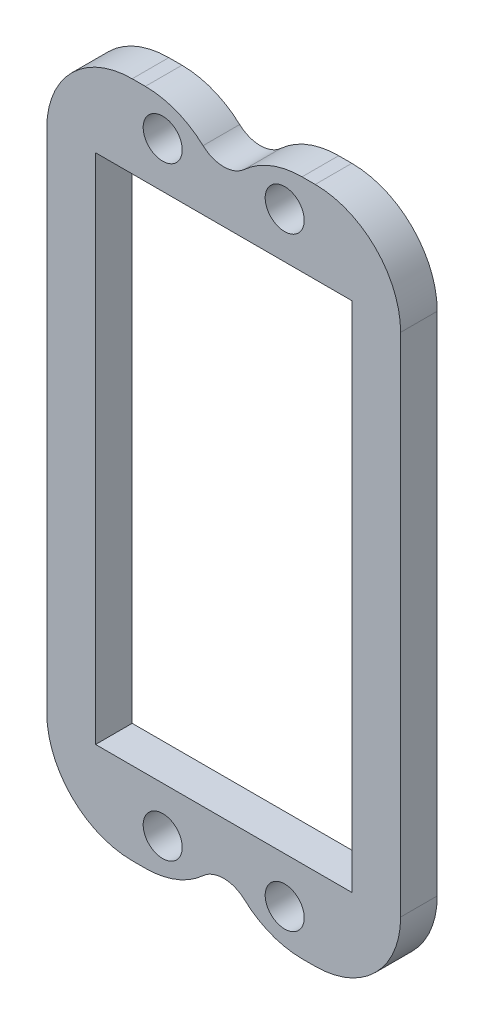
ISO-10303-21;
HEADER;
FILE_DESCRIPTION(('STEP AP214'),'2;1');
FILE_NAME('part.step','',(''),(''),'','','');
FILE_SCHEMA(('AUTOMOTIVE_DESIGN { 1 0 10303 214 1 1 1 1 }'));
ENDSEC;
DATA;
#1=APPLICATION_CONTEXT('core data for automotive mechanical design processes');
#2=APPLICATION_PROTOCOL_DEFINITION('international standard','automotive_design',2000,#1);
#3=PRODUCT_CONTEXT('',#1,'mechanical');
#4=PRODUCT('Part','Part','',(#3));
#5=PRODUCT_RELATED_PRODUCT_CATEGORY('part','',(#4));
#6=PRODUCT_DEFINITION_FORMATION('','',#4);
#7=PRODUCT_DEFINITION_CONTEXT('part definition',#1,'design');
#8=PRODUCT_DEFINITION('design','',#6,#7);
#9=PRODUCT_DEFINITION_SHAPE('','',#8);
#10=(LENGTH_UNIT() NAMED_UNIT(*) SI_UNIT(.MILLI.,.METRE.));
#11=(NAMED_UNIT(*) PLANE_ANGLE_UNIT() SI_UNIT($,.RADIAN.));
#12=(NAMED_UNIT(*) SI_UNIT($,.STERADIAN.) SOLID_ANGLE_UNIT());
#13=UNCERTAINTY_MEASURE_WITH_UNIT(LENGTH_MEASURE(1.E-05),#10,'distance_accuracy_value','');
#14=(GEOMETRIC_REPRESENTATION_CONTEXT(3) GLOBAL_UNCERTAINTY_ASSIGNED_CONTEXT((#13)) GLOBAL_UNIT_ASSIGNED_CONTEXT((#10,
#11,#12)) REPRESENTATION_CONTEXT('',''));
#15=CARTESIAN_POINT('',(0.,0.,0.));
#16=DIRECTION('',(0.,0.,1.));
#17=DIRECTION('',(1.,0.,0.));
#18=AXIS2_PLACEMENT_3D('',#15,#16,#17);
#19=CARTESIAN_POINT('',(0.,-27.75,3.));
#20=DIRECTION('',(0.,1.,0.));
#21=DIRECTION('',(-1.,0.,0.));
#22=AXIS2_PLACEMENT_3D('',#19,#20,#21);
#23=PLANE('',#22);
#24=DIRECTION('',(1.,0.,0.));
#25=VECTOR('',#24,1.);
#26=CARTESIAN_POINT('',(0.,-27.75,0.));
#27=LINE('',#26,#25);
#28=CARTESIAN_POINT('',(-7.5,-27.75,0.));
#29=VERTEX_POINT('',#28);
#30=CARTESIAN_POINT('',(-6.42261628933258,-27.75,0.));
#31=VERTEX_POINT('',#30);
#32=EDGE_CURVE('E249',#29,#31,#27,.T.);
#33=ORIENTED_EDGE('',*,*,#32,.T.);
#34=DIRECTION('',(0.,0.,-1.));
#35=VECTOR('',#34,1.);
#36=CARTESIAN_POINT('',(-6.42261628933258,-27.75,3.));
#37=LINE('',#36,#35);
#38=CARTESIAN_POINT('',(-6.42261628933258,-27.75,3.));
#39=VERTEX_POINT('',#38);
#40=EDGE_CURVE('E318',#31,#39,#37,.F.);
#41=ORIENTED_EDGE('',*,*,#40,.T.);
#42=DIRECTION('',(1.,0.,0.));
#43=VECTOR('',#42,1.);
#44=CARTESIAN_POINT('',(0.,-27.75,3.));
#45=LINE('',#44,#43);
#46=CARTESIAN_POINT('',(-7.5,-27.75,3.));
#47=VERTEX_POINT('',#46);
#48=EDGE_CURVE('E208',#47,#39,#45,.T.);
#49=ORIENTED_EDGE('',*,*,#48,.F.);
#50=DIRECTION('',(0.,0.,-1.));
#51=VECTOR('',#50,1.);
#52=CARTESIAN_POINT('',(-7.5,-27.75,0.));
#53=LINE('',#52,#51);
#54=EDGE_CURVE('E315',#47,#29,#53,.T.);
#55=ORIENTED_EDGE('',*,*,#54,.T.);
#56=EDGE_LOOP('',(#33,#41,#49,#55));
#57=FACE_BOUND('',#56,.T.);
#58=ADVANCED_FACE('F34',(#57),#23,.F.);
#59=CARTESIAN_POINT('',(0.,-27.75,3.));
#60=DIRECTION('',(0.,0.,-1.));
#61=DIRECTION('',(-1.,0.,0.));
#62=AXIS2_PLACEMENT_3D('',#59,#60,#61);
#63=CYLINDRICAL_SURFACE('',#62,2.5);
#64=CARTESIAN_POINT('',(0.,-27.75,0.));
#65=DIRECTION('',(0.,0.,1.));
#66=DIRECTION('',(1.,0.,0.));
#67=AXIS2_PLACEMENT_3D('',#64,#65,#66);
#68=CIRCLE('',#67,2.5);
#69=CARTESIAN_POINT('',(-1.69016218140331,-25.9078947368421,0.));
#70=VERTEX_POINT('',#69);
#71=CARTESIAN_POINT('',(1.69016218140331,-25.9078947368421,0.));
#72=VERTEX_POINT('',#71);
#73=EDGE_CURVE('E252',#70,#72,#68,.F.);
#74=ORIENTED_EDGE('',*,*,#73,.T.);
#75=DIRECTION('',(0.,0.,-1.));
#76=VECTOR('',#75,1.);
#77=CARTESIAN_POINT('',(1.69016218140331,-25.9078947368421,3.));
#78=LINE('',#77,#76);
#79=CARTESIAN_POINT('',(1.69016218140331,-25.9078947368421,3.));
#80=VERTEX_POINT('',#79);
#81=EDGE_CURVE('E298',#72,#80,#78,.F.);
#82=ORIENTED_EDGE('',*,*,#81,.T.);
#83=CARTESIAN_POINT('',(0.,-27.75,3.));
#84=DIRECTION('',(0.,0.,1.));
#85=DIRECTION('',(1.,0.,0.));
#86=AXIS2_PLACEMENT_3D('',#83,#84,#85);
#87=CIRCLE('',#86,2.5);
#88=CARTESIAN_POINT('',(-1.69016218140331,-25.9078947368421,3.));
#89=VERTEX_POINT('',#88);
#90=EDGE_CURVE('E211',#89,#80,#87,.F.);
#91=ORIENTED_EDGE('',*,*,#90,.F.);
#92=DIRECTION('',(0.,0.,-1.));
#93=VECTOR('',#92,1.);
#94=CARTESIAN_POINT('',(-1.69016218140331,-25.9078947368421,3.));
#95=LINE('',#94,#93);
#96=EDGE_CURVE('E295',#89,#70,#95,.T.);
#97=ORIENTED_EDGE('',*,*,#96,.T.);
#98=EDGE_LOOP('',(#74,#82,#91,#97));
#99=FACE_BOUND('',#98,.T.);
#100=ADVANCED_FACE('F363',(#99),#63,.F.);
#101=CARTESIAN_POINT('',(6.42261628933258,-27.75,3.));
#102=VERTEX_POINT('',#101);
#103=CARTESIAN_POINT('',(7.50000000000001,-27.75,3.));
#104=VERTEX_POINT('',#103);
#105=EDGE_CURVE('E212',#102,#104,#45,.T.);
#106=ORIENTED_EDGE('',*,*,#105,.F.);
#107=DIRECTION('',(0.,0.,-1.));
#108=VECTOR('',#107,1.);
#109=CARTESIAN_POINT('',(6.42261628933258,-27.75,3.));
#110=LINE('',#109,#108);
#111=CARTESIAN_POINT('',(6.42261628933258,-27.75,0.));
#112=VERTEX_POINT('',#111);
#113=EDGE_CURVE('E276',#102,#112,#110,.T.);
#114=ORIENTED_EDGE('',*,*,#113,.T.);
#115=CARTESIAN_POINT('',(7.50000000000001,-27.75,0.));
#116=VERTEX_POINT('',#115);
#117=EDGE_CURVE('E253',#112,#116,#27,.T.);
#118=ORIENTED_EDGE('',*,*,#117,.T.);
#119=DIRECTION('',(0.,0.,-1.));
#120=VECTOR('',#119,1.);
#121=CARTESIAN_POINT('',(7.50000000000001,-27.75,3.));
#122=LINE('',#121,#120);
#123=EDGE_CURVE('E181',#116,#104,#122,.F.);
#124=ORIENTED_EDGE('',*,*,#123,.T.);
#125=EDGE_LOOP('',(#106,#114,#118,#124));
#126=FACE_BOUND('',#125,.T.);
#127=ADVANCED_FACE('F372',(#126),#23,.F.);
#128=CARTESIAN_POINT('',(14.5,0.,3.));
#129=DIRECTION('',(-1.,0.,0.));
#130=DIRECTION('',(0.,0.,1.));
#131=AXIS2_PLACEMENT_3D('',#128,#129,#130);
#132=PLANE('',#131);
#133=DIRECTION('',(0.,1.,0.));
#134=VECTOR('',#133,1.);
#135=CARTESIAN_POINT('',(14.5,0.,3.));
#136=LINE('',#135,#134);
#137=CARTESIAN_POINT('',(14.5,-20.75,3.));
#138=VERTEX_POINT('',#137);
#139=CARTESIAN_POINT('',(14.5,20.75,3.));
#140=VERTEX_POINT('',#139);
#141=EDGE_CURVE('E215',#138,#140,#136,.T.);
#142=ORIENTED_EDGE('',*,*,#141,.F.);
#143=DIRECTION('',(0.,0.,-1.));
#144=VECTOR('',#143,1.);
#145=CARTESIAN_POINT('',(14.5,-20.75,3.));
#146=LINE('',#145,#144);
#147=CARTESIAN_POINT('',(14.5,-20.75,0.));
#148=VERTEX_POINT('',#147);
#149=EDGE_CURVE('E337',#138,#148,#146,.T.);
#150=ORIENTED_EDGE('',*,*,#149,.T.);
#151=DIRECTION('',(0.,1.,0.));
#152=VECTOR('',#151,1.);
#153=CARTESIAN_POINT('',(14.5,0.,0.));
#154=LINE('',#153,#152);
#155=CARTESIAN_POINT('',(14.5,20.75,0.));
#156=VERTEX_POINT('',#155);
#157=EDGE_CURVE('E256',#148,#156,#154,.T.);
#158=ORIENTED_EDGE('',*,*,#157,.T.);
#159=DIRECTION('',(0.,0.,-1.));
#160=VECTOR('',#159,1.);
#161=CARTESIAN_POINT('',(14.5,20.75,3.));
#162=LINE('',#161,#160);
#163=EDGE_CURVE('E335',#156,#140,#162,.F.);
#164=ORIENTED_EDGE('',*,*,#163,.T.);
#165=EDGE_LOOP('',(#142,#150,#158,#164));
#166=FACE_BOUND('',#165,.T.);
#167=ADVANCED_FACE('F382',(#166),#132,.F.);
#168=CARTESIAN_POINT('',(0.,27.75,3.));
#169=DIRECTION('',(0.,1.,0.));
#170=DIRECTION('',(-1.,0.,0.));
#171=AXIS2_PLACEMENT_3D('',#168,#169,#170);
#172=PLANE('',#171);
#173=DIRECTION('',(1.,0.,0.));
#174=VECTOR('',#173,1.);
#175=CARTESIAN_POINT('',(0.,27.75,0.));
#176=LINE('',#175,#174);
#177=CARTESIAN_POINT('',(6.42261628933257,27.75,0.));
#178=VERTEX_POINT('',#177);
#179=CARTESIAN_POINT('',(7.50000000000001,27.75,0.));
#180=VERTEX_POINT('',#179);
#181=EDGE_CURVE('E259',#178,#180,#176,.T.);
#182=ORIENTED_EDGE('',*,*,#181,.F.);
#183=DIRECTION('',(0.,0.,-1.));
#184=VECTOR('',#183,1.);
#185=CARTESIAN_POINT('',(6.42261628933257,27.75,3.));
#186=LINE('',#185,#184);
#187=CARTESIAN_POINT('',(6.42261628933257,27.75,3.));
#188=VERTEX_POINT('',#187);
#189=EDGE_CURVE('E328',#178,#188,#186,.F.);
#190=ORIENTED_EDGE('',*,*,#189,.T.);
#191=DIRECTION('',(1.,0.,0.));
#192=VECTOR('',#191,1.);
#193=CARTESIAN_POINT('',(0.,27.75,3.));
#194=LINE('',#193,#192);
#195=CARTESIAN_POINT('',(7.50000000000001,27.75,3.));
#196=VERTEX_POINT('',#195);
#197=EDGE_CURVE('E218',#188,#196,#194,.T.);
#198=ORIENTED_EDGE('',*,*,#197,.T.);
#199=DIRECTION('',(0.,0.,-1.));
#200=VECTOR('',#199,1.);
#201=CARTESIAN_POINT('',(7.50000000000001,27.75,0.));
#202=LINE('',#201,#200);
#203=EDGE_CURVE('E325',#196,#180,#202,.T.);
#204=ORIENTED_EDGE('',*,*,#203,.T.);
#205=EDGE_LOOP('',(#182,#190,#198,#204));
#206=FACE_BOUND('',#205,.T.);
#207=ADVANCED_FACE('F390',(#206),#172,.T.);
#208=CARTESIAN_POINT('',(0.,27.75,3.));
#209=DIRECTION('',(0.,0.,-1.));
#210=DIRECTION('',(-1.,0.,0.));
#211=AXIS2_PLACEMENT_3D('',#208,#209,#210);
#212=CYLINDRICAL_SURFACE('',#211,2.5);
#213=CARTESIAN_POINT('',(0.,27.75,3.));
#214=DIRECTION('',(0.,0.,1.));
#215=DIRECTION('',(1.,0.,0.));
#216=AXIS2_PLACEMENT_3D('',#213,#214,#215);
#217=CIRCLE('',#216,2.5);
#218=CARTESIAN_POINT('',(-1.69016218140331,25.9078947368421,3.));
#219=VERTEX_POINT('',#218);
#220=CARTESIAN_POINT('',(1.69016218140331,25.9078947368421,3.));
#221=VERTEX_POINT('',#220);
#222=EDGE_CURVE('E223',#219,#221,#217,.T.);
#223=ORIENTED_EDGE('',*,*,#222,.T.);
#224=DIRECTION('',(0.,0.,-1.));
#225=VECTOR('',#224,1.);
#226=CARTESIAN_POINT('',(1.69016218140331,25.9078947368421,3.));
#227=LINE('',#226,#225);
#228=CARTESIAN_POINT('',(1.69016218140331,25.9078947368421,0.));
#229=VERTEX_POINT('',#228);
#230=EDGE_CURVE('E322',#221,#229,#227,.T.);
#231=ORIENTED_EDGE('',*,*,#230,.T.);
#232=CARTESIAN_POINT('',(0.,27.75,0.));
#233=DIRECTION('',(0.,0.,1.));
#234=DIRECTION('',(1.,0.,0.));
#235=AXIS2_PLACEMENT_3D('',#232,#233,#234);
#236=CIRCLE('',#235,2.5);
#237=CARTESIAN_POINT('',(-1.69016218140331,25.9078947368421,0.));
#238=VERTEX_POINT('',#237);
#239=EDGE_CURVE('E262',#238,#229,#236,.T.);
#240=ORIENTED_EDGE('',*,*,#239,.F.);
#241=DIRECTION('',(0.,0.,-1.));
#242=VECTOR('',#241,1.);
#243=CARTESIAN_POINT('',(-1.69016218140331,25.9078947368421,3.));
#244=LINE('',#243,#242);
#245=EDGE_CURVE('E320',#238,#219,#244,.F.);
#246=ORIENTED_EDGE('',*,*,#245,.T.);
#247=EDGE_LOOP('',(#223,#231,#240,#246));
#248=FACE_BOUND('',#247,.T.);
#249=ADVANCED_FACE('F400',(#248),#212,.F.);
#250=CARTESIAN_POINT('',(-7.50000000000001,27.75,3.));
#251=VERTEX_POINT('',#250);
#252=CARTESIAN_POINT('',(-6.42261628933257,27.75,3.));
#253=VERTEX_POINT('',#252);
#254=EDGE_CURVE('E219',#251,#253,#194,.T.);
#255=ORIENTED_EDGE('',*,*,#254,.T.);
#256=DIRECTION('',(0.,0.,-1.));
#257=VECTOR('',#256,1.);
#258=CARTESIAN_POINT('',(-6.42261628933257,27.75,3.));
#259=LINE('',#258,#257);
#260=CARTESIAN_POINT('',(-6.42261628933257,27.75,0.));
#261=VERTEX_POINT('',#260);
#262=EDGE_CURVE('E332',#253,#261,#259,.T.);
#263=ORIENTED_EDGE('',*,*,#262,.T.);
#264=CARTESIAN_POINT('',(-7.50000000000001,27.75,0.));
#265=VERTEX_POINT('',#264);
#266=EDGE_CURVE('E263',#265,#261,#176,.T.);
#267=ORIENTED_EDGE('',*,*,#266,.F.);
#268=DIRECTION('',(0.,0.,-1.));
#269=VECTOR('',#268,1.);
#270=CARTESIAN_POINT('',(-7.50000000000001,27.75,3.));
#271=LINE('',#270,#269);
#272=EDGE_CURVE('E330',#265,#251,#271,.F.);
#273=ORIENTED_EDGE('',*,*,#272,.T.);
#274=EDGE_LOOP('',(#255,#263,#267,#273));
#275=FACE_BOUND('',#274,.T.);
#276=ADVANCED_FACE('F407',(#275),#172,.T.);
#277=CARTESIAN_POINT('',(10.5,0.,3.));
#278=DIRECTION('',(-1.,0.,0.));
#279=DIRECTION('',(0.,0.,1.));
#280=AXIS2_PLACEMENT_3D('',#277,#278,#279);
#281=PLANE('',#280);
#282=DIRECTION('',(0.,1.,0.));
#283=VECTOR('',#282,1.);
#284=CARTESIAN_POINT('',(10.5,0.,0.));
#285=LINE('',#284,#283);
#286=CARTESIAN_POINT('',(10.5,-21.,0.));
#287=VERTEX_POINT('',#286);
#288=CARTESIAN_POINT('',(10.5,21.,0.));
#289=VERTEX_POINT('',#288);
#290=EDGE_CURVE('E176',#287,#289,#285,.T.);
#291=ORIENTED_EDGE('',*,*,#290,.F.);
#292=DIRECTION('',(0.,0.,-1.));
#293=VECTOR('',#292,1.);
#294=CARTESIAN_POINT('',(10.5,-21.,3.));
#295=LINE('',#294,#293);
#296=CARTESIAN_POINT('',(10.5,-21.,3.));
#297=VERTEX_POINT('',#296);
#298=EDGE_CURVE('E171',#297,#287,#295,.T.);
#299=ORIENTED_EDGE('',*,*,#298,.F.);
#300=DIRECTION('',(0.,1.,0.));
#301=VECTOR('',#300,1.);
#302=CARTESIAN_POINT('',(10.5,0.,3.));
#303=LINE('',#302,#301);
#304=CARTESIAN_POINT('',(10.5,21.,3.));
#305=VERTEX_POINT('',#304);
#306=EDGE_CURVE('E174',#297,#305,#303,.T.);
#307=ORIENTED_EDGE('',*,*,#306,.T.);
#308=DIRECTION('',(0.,0.,-1.));
#309=VECTOR('',#308,1.);
#310=CARTESIAN_POINT('',(10.5,21.,3.));
#311=LINE('',#310,#309);
#312=EDGE_CURVE('E227',#305,#289,#311,.T.);
#313=ORIENTED_EDGE('',*,*,#312,.T.);
#314=EDGE_LOOP('',(#291,#299,#307,#313));
#315=FACE_BOUND('',#314,.T.);
#316=ADVANCED_FACE('F173',(#315),#281,.T.);
#317=CARTESIAN_POINT('',(0.,-21.,3.));
#318=DIRECTION('',(0.,1.,0.));
#319=DIRECTION('',(0.,0.,1.));
#320=AXIS2_PLACEMENT_3D('',#317,#318,#319);
#321=PLANE('',#320);
#322=DIRECTION('',(1.,0.,0.));
#323=VECTOR('',#322,1.);
#324=CARTESIAN_POINT('',(0.,-21.,0.));
#325=LINE('',#324,#323);
#326=CARTESIAN_POINT('',(-10.5,-21.,0.));
#327=VERTEX_POINT('',#326);
#328=EDGE_CURVE('E235',#327,#287,#325,.T.);
#329=ORIENTED_EDGE('',*,*,#328,.F.);
#330=DIRECTION('',(0.,0.,-1.));
#331=VECTOR('',#330,1.);
#332=CARTESIAN_POINT('',(-10.5,-21.,3.));
#333=LINE('',#332,#331);
#334=CARTESIAN_POINT('',(-10.5,-21.,3.));
#335=VERTEX_POINT('',#334);
#336=EDGE_CURVE('E182',#335,#327,#333,.T.);
#337=ORIENTED_EDGE('',*,*,#336,.F.);
#338=DIRECTION('',(1.,0.,0.));
#339=VECTOR('',#338,1.);
#340=CARTESIAN_POINT('',(0.,-21.,3.));
#341=LINE('',#340,#339);
#342=EDGE_CURVE('E189',#335,#297,#341,.T.);
#343=ORIENTED_EDGE('',*,*,#342,.T.);
#344=ORIENTED_EDGE('',*,*,#298,.T.);
#345=EDGE_LOOP('',(#329,#337,#343,#344));
#346=FACE_BOUND('',#345,.T.);
#347=ADVANCED_FACE('F194',(#346),#321,.T.);
#348=CARTESIAN_POINT('',(-10.5,0.,3.));
#349=DIRECTION('',(-1.,0.,0.));
#350=DIRECTION('',(0.,0.,1.));
#351=AXIS2_PLACEMENT_3D('',#348,#349,#350);
#352=PLANE('',#351);
#353=DIRECTION('',(0.,1.,0.));
#354=VECTOR('',#353,1.);
#355=CARTESIAN_POINT('',(-10.5,0.,0.));
#356=LINE('',#355,#354);
#357=CARTESIAN_POINT('',(-10.5,21.,0.));
#358=VERTEX_POINT('',#357);
#359=EDGE_CURVE('E237',#327,#358,#356,.T.);
#360=ORIENTED_EDGE('',*,*,#359,.T.);
#361=DIRECTION('',(0.,0.,-1.));
#362=VECTOR('',#361,1.);
#363=CARTESIAN_POINT('',(-10.5,21.,3.));
#364=LINE('',#363,#362);
#365=CARTESIAN_POINT('',(-10.5,21.,3.));
#366=VERTEX_POINT('',#365);
#367=EDGE_CURVE('E271',#366,#358,#364,.T.);
#368=ORIENTED_EDGE('',*,*,#367,.F.);
#369=DIRECTION('',(0.,1.,0.));
#370=VECTOR('',#369,1.);
#371=CARTESIAN_POINT('',(-10.5,0.,3.));
#372=LINE('',#371,#370);
#373=EDGE_CURVE('E196',#335,#366,#372,.T.);
#374=ORIENTED_EDGE('',*,*,#373,.F.);
#375=ORIENTED_EDGE('',*,*,#336,.T.);
#376=EDGE_LOOP('',(#360,#368,#374,#375));
#377=FACE_BOUND('',#376,.T.);
#378=ADVANCED_FACE('F468',(#377),#352,.F.);
#379=CARTESIAN_POINT('',(-4.99999999999999,24.75,3.));
#380=DIRECTION('',(0.,0.,-1.));
#381=DIRECTION('',(-1.,0.,0.));
#382=AXIS2_PLACEMENT_3D('',#379,#380,#381);
#383=CYLINDRICAL_SURFACE('',#382,1.6);
#384=CARTESIAN_POINT('',(-4.99999999999999,24.75,3.));
#385=DIRECTION('',(0.,0.,1.));
#386=DIRECTION('',(1.,0.,0.));
#387=AXIS2_PLACEMENT_3D('',#384,#385,#386);
#388=CIRCLE('',#387,1.6);
#389=CARTESIAN_POINT('',(-3.4,24.75,3.));
#390=VERTEX_POINT('',#389);
#391=EDGE_CURVE('E205',#390,#390,#388,.F.);
#392=ORIENTED_EDGE('',*,*,#391,.F.);
#393=EDGE_LOOP('',(#392));
#394=FACE_BOUND('',#393,.T.);
#395=CARTESIAN_POINT('',(-4.99999999999999,24.75,0.));
#396=DIRECTION('',(0.,0.,1.));
#397=DIRECTION('',(1.,0.,0.));
#398=AXIS2_PLACEMENT_3D('',#395,#396,#397);
#399=CIRCLE('',#398,1.6);
#400=CARTESIAN_POINT('',(-3.4,24.75,0.));
#401=VERTEX_POINT('',#400);
#402=EDGE_CURVE('E246',#401,#401,#399,.F.);
#403=ORIENTED_EDGE('',*,*,#402,.T.);
#404=EDGE_LOOP('',(#403));
#405=FACE_BOUND('',#404,.T.);
#406=ADVANCED_FACE('F465',(#394,#405),#383,.F.);
#407=CARTESIAN_POINT('',(5.,24.75,3.));
#408=DIRECTION('',(0.,0.,-1.));
#409=DIRECTION('',(-1.,0.,0.));
#410=AXIS2_PLACEMENT_3D('',#407,#408,#409);
#411=CYLINDRICAL_SURFACE('',#410,1.6);
#412=CARTESIAN_POINT('',(5.,24.75,3.));
#413=DIRECTION('',(0.,0.,1.));
#414=DIRECTION('',(1.,0.,0.));
#415=AXIS2_PLACEMENT_3D('',#412,#413,#414);
#416=CIRCLE('',#415,1.6);
#417=CARTESIAN_POINT('',(6.6,24.75,3.));
#418=VERTEX_POINT('',#417);
#419=EDGE_CURVE('E202',#418,#418,#416,.T.);
#420=ORIENTED_EDGE('',*,*,#419,.T.);
#421=EDGE_LOOP('',(#420));
#422=FACE_BOUND('',#421,.T.);
#423=CARTESIAN_POINT('',(5.,24.75,0.));
#424=DIRECTION('',(0.,0.,1.));
#425=DIRECTION('',(1.,0.,0.));
#426=AXIS2_PLACEMENT_3D('',#423,#424,#425);
#427=CIRCLE('',#426,1.6);
#428=CARTESIAN_POINT('',(6.6,24.75,0.));
#429=VERTEX_POINT('',#428);
#430=EDGE_CURVE('E243',#429,#429,#427,.T.);
#431=ORIENTED_EDGE('',*,*,#430,.F.);
#432=EDGE_LOOP('',(#431));
#433=FACE_BOUND('',#432,.T.);
#434=ADVANCED_FACE('F467',(#422,#433),#411,.F.);
#435=CARTESIAN_POINT('',(0.,21.,3.));
#436=DIRECTION('',(0.,1.,0.));
#437=DIRECTION('',(0.,0.,1.));
#438=AXIS2_PLACEMENT_3D('',#435,#436,#437);
#439=PLANE('',#438);
#440=DIRECTION('',(1.,0.,0.));
#441=VECTOR('',#440,1.);
#442=CARTESIAN_POINT('',(0.,21.,0.));
#443=LINE('',#442,#441);
#444=EDGE_CURVE('E240',#358,#289,#443,.T.);
#445=ORIENTED_EDGE('',*,*,#444,.T.);
#446=ORIENTED_EDGE('',*,*,#312,.F.);
#447=DIRECTION('',(1.,0.,0.));
#448=VECTOR('',#447,1.);
#449=CARTESIAN_POINT('',(0.,21.,3.));
#450=LINE('',#449,#448);
#451=EDGE_CURVE('E190',#366,#305,#450,.T.);
#452=ORIENTED_EDGE('',*,*,#451,.F.);
#453=ORIENTED_EDGE('',*,*,#367,.T.);
#454=EDGE_LOOP('',(#445,#446,#452,#453));
#455=FACE_BOUND('',#454,.T.);
#456=ADVANCED_FACE('F455',(#455),#439,.F.);
#457=CARTESIAN_POINT('',(-4.99999999999999,-24.75,3.));
#458=DIRECTION('',(0.,0.,-1.));
#459=DIRECTION('',(-1.,0.,0.));
#460=AXIS2_PLACEMENT_3D('',#457,#458,#459);
#461=CYLINDRICAL_SURFACE('',#460,1.6);
#462=CARTESIAN_POINT('',(-4.99999999999999,-24.75,3.));
#463=DIRECTION('',(0.,0.,1.));
#464=DIRECTION('',(1.,0.,0.));
#465=AXIS2_PLACEMENT_3D('',#462,#463,#464);
#466=CIRCLE('',#465,1.6);
#467=CARTESIAN_POINT('',(-3.4,-24.75,3.));
#468=VERTEX_POINT('',#467);
#469=EDGE_CURVE('E192',#468,#468,#466,.T.);
#470=ORIENTED_EDGE('',*,*,#469,.T.);
#471=EDGE_LOOP('',(#470));
#472=FACE_BOUND('',#471,.T.);
#473=CARTESIAN_POINT('',(-4.99999999999999,-24.75,0.));
#474=DIRECTION('',(0.,0.,1.));
#475=DIRECTION('',(1.,0.,0.));
#476=AXIS2_PLACEMENT_3D('',#473,#474,#475);
#477=CIRCLE('',#476,1.6);
#478=CARTESIAN_POINT('',(-3.4,-24.75,0.));
#479=VERTEX_POINT('',#478);
#480=EDGE_CURVE('E231',#479,#479,#477,.T.);
#481=ORIENTED_EDGE('',*,*,#480,.F.);
#482=EDGE_LOOP('',(#481));
#483=FACE_BOUND('',#482,.T.);
#484=ADVANCED_FACE('F452',(#472,#483),#461,.F.);
#485=CARTESIAN_POINT('',(5.00000000000001,-24.75,3.));
#486=DIRECTION('',(0.,0.,-1.));
#487=DIRECTION('',(-1.,0.,0.));
#488=AXIS2_PLACEMENT_3D('',#485,#486,#487);
#489=CYLINDRICAL_SURFACE('',#488,1.6);
#490=CARTESIAN_POINT('',(5.00000000000001,-24.75,3.));
#491=DIRECTION('',(0.,0.,1.));
#492=DIRECTION('',(1.,0.,0.));
#493=AXIS2_PLACEMENT_3D('',#490,#491,#492);
#494=CIRCLE('',#493,1.6);
#495=CARTESIAN_POINT('',(6.6,-24.75,3.));
#496=VERTEX_POINT('',#495);
#497=EDGE_CURVE('E269',#496,#496,#494,.F.);
#498=ORIENTED_EDGE('',*,*,#497,.F.);
#499=EDGE_LOOP('',(#498));
#500=FACE_BOUND('',#499,.T.);
#501=CARTESIAN_POINT('',(5.00000000000001,-24.75,0.));
#502=DIRECTION('',(0.,0.,1.));
#503=DIRECTION('',(1.,0.,0.));
#504=AXIS2_PLACEMENT_3D('',#501,#502,#503);
#505=CIRCLE('',#504,1.6);
#506=CARTESIAN_POINT('',(6.6,-24.75,0.));
#507=VERTEX_POINT('',#506);
#508=EDGE_CURVE('E228',#507,#507,#505,.F.);
#509=ORIENTED_EDGE('',*,*,#508,.T.);
#510=EDGE_LOOP('',(#509));
#511=FACE_BOUND('',#510,.T.);
#512=ADVANCED_FACE('F437',(#500,#511),#489,.F.);
#513=CARTESIAN_POINT('',(-14.5,0.,3.));
#514=DIRECTION('',(-1.,0.,0.));
#515=DIRECTION('',(0.,-1.,0.));
#516=AXIS2_PLACEMENT_3D('',#513,#514,#515);
#517=PLANE('',#516);
#518=DIRECTION('',(0.,1.,0.));
#519=VECTOR('',#518,1.);
#520=CARTESIAN_POINT('',(-14.5,0.,0.));
#521=LINE('',#520,#519);
#522=CARTESIAN_POINT('',(-14.5,-20.75,0.));
#523=VERTEX_POINT('',#522);
#524=CARTESIAN_POINT('',(-14.5,20.75,0.));
#525=VERTEX_POINT('',#524);
#526=EDGE_CURVE('E266',#523,#525,#521,.T.);
#527=ORIENTED_EDGE('',*,*,#526,.F.);
#528=DIRECTION('',(0.,0.,-1.));
#529=VECTOR('',#528,1.);
#530=CARTESIAN_POINT('',(-14.5,-20.75,3.));
#531=LINE('',#530,#529);
#532=CARTESIAN_POINT('',(-14.5,-20.75,3.));
#533=VERTEX_POINT('',#532);
#534=EDGE_CURVE('E11',#523,#533,#531,.F.);
#535=ORIENTED_EDGE('',*,*,#534,.T.);
#536=DIRECTION('',(0.,1.,0.));
#537=VECTOR('',#536,1.);
#538=CARTESIAN_POINT('',(-14.5,0.,3.));
#539=LINE('',#538,#537);
#540=CARTESIAN_POINT('',(-14.5,20.75,3.));
#541=VERTEX_POINT('',#540);
#542=EDGE_CURVE('E222',#533,#541,#539,.T.);
#543=ORIENTED_EDGE('',*,*,#542,.T.);
#544=DIRECTION('',(0.,0.,-1.));
#545=VECTOR('',#544,1.);
#546=CARTESIAN_POINT('',(-14.5,20.75,3.));
#547=LINE('',#546,#545);
#548=EDGE_CURVE('E42',#541,#525,#547,.T.);
#549=ORIENTED_EDGE('',*,*,#548,.T.);
#550=EDGE_LOOP('',(#527,#535,#543,#549));
#551=FACE_BOUND('',#550,.T.);
#552=ADVANCED_FACE('F341',(#551),#517,.T.);
#553=CARTESIAN_POINT('',(0.,0.,3.));
#554=DIRECTION('',(0.,0.,1.));
#555=DIRECTION('',(1.,0.,0.));
#556=AXIS2_PLACEMENT_3D('',#553,#554,#555);
#557=PLANE('',#556);
#558=ORIENTED_EDGE('',*,*,#497,.T.);
#559=EDGE_LOOP('',(#558));
#560=FACE_BOUND('',#559,.T.);
#561=ORIENTED_EDGE('',*,*,#469,.F.);
#562=EDGE_LOOP('',(#561));
#563=FACE_BOUND('',#562,.T.);
#564=ORIENTED_EDGE('',*,*,#306,.F.);
#565=ORIENTED_EDGE('',*,*,#342,.F.);
#566=ORIENTED_EDGE('',*,*,#373,.T.);
#567=ORIENTED_EDGE('',*,*,#451,.T.);
#568=EDGE_LOOP('',(#564,#565,#566,#567));
#569=FACE_BOUND('',#568,.T.);
#570=ORIENTED_EDGE('',*,*,#419,.F.);
#571=EDGE_LOOP('',(#570));
#572=FACE_BOUND('',#571,.T.);
#573=ORIENTED_EDGE('',*,*,#391,.T.);
#574=EDGE_LOOP('',(#573));
#575=FACE_BOUND('',#574,.T.);
#576=ORIENTED_EDGE('',*,*,#90,.T.);
#577=CARTESIAN_POINT('',(6.42261628933257,-20.75,3.));
#578=DIRECTION('',(0.,0.,1.));
#579=DIRECTION('',(1.,0.,0.));
#580=AXIS2_PLACEMENT_3D('',#577,#578,#579);
#581=CIRCLE('',#580,7.);
#582=EDGE_CURVE('E313',#80,#102,#581,.T.);
#583=ORIENTED_EDGE('',*,*,#582,.T.);
#584=ORIENTED_EDGE('',*,*,#105,.T.);
#585=CARTESIAN_POINT('',(7.50000000000001,-20.75,3.));
#586=DIRECTION('',(0.,0.,1.));
#587=DIRECTION('',(1.,0.,0.));
#588=AXIS2_PLACEMENT_3D('',#585,#586,#587);
#589=CIRCLE('',#588,7.);
#590=EDGE_CURVE('E305',#104,#138,#589,.T.);
#591=ORIENTED_EDGE('',*,*,#590,.T.);
#592=ORIENTED_EDGE('',*,*,#141,.T.);
#593=CARTESIAN_POINT('',(7.50000000000001,20.75,3.));
#594=DIRECTION('',(0.,0.,1.));
#595=DIRECTION('',(1.,0.,0.));
#596=AXIS2_PLACEMENT_3D('',#593,#594,#595);
#597=CIRCLE('',#596,7.);
#598=EDGE_CURVE('E300',#140,#196,#597,.T.);
#599=ORIENTED_EDGE('',*,*,#598,.T.);
#600=ORIENTED_EDGE('',*,*,#197,.F.);
#601=CARTESIAN_POINT('',(6.42261628933257,20.75,3.));
#602=DIRECTION('',(0.,0.,1.));
#603=DIRECTION('',(1.,0.,0.));
#604=AXIS2_PLACEMENT_3D('',#601,#602,#603);
#605=CIRCLE('',#604,7.);
#606=EDGE_CURVE('E309',#188,#221,#605,.T.);
#607=ORIENTED_EDGE('',*,*,#606,.T.);
#608=ORIENTED_EDGE('',*,*,#222,.F.);
#609=CARTESIAN_POINT('',(-6.42261628933257,20.75,3.));
#610=DIRECTION('',(0.,0.,1.));
#611=DIRECTION('',(1.,0.,0.));
#612=AXIS2_PLACEMENT_3D('',#609,#610,#611);
#613=CIRCLE('',#612,7.);
#614=EDGE_CURVE('E307',#219,#253,#613,.T.);
#615=ORIENTED_EDGE('',*,*,#614,.T.);
#616=ORIENTED_EDGE('',*,*,#254,.F.);
#617=CARTESIAN_POINT('',(-7.50000000000001,20.75,3.));
#618=DIRECTION('',(0.,0.,1.));
#619=DIRECTION('',(1.,0.,0.));
#620=AXIS2_PLACEMENT_3D('',#617,#618,#619);
#621=CIRCLE('',#620,7.);
#622=EDGE_CURVE('E49',#251,#541,#621,.T.);
#623=ORIENTED_EDGE('',*,*,#622,.T.);
#624=ORIENTED_EDGE('',*,*,#542,.F.);
#625=CARTESIAN_POINT('',(-7.5,-20.75,3.));
#626=DIRECTION('',(0.,0.,1.));
#627=DIRECTION('',(1.,0.,0.));
#628=AXIS2_PLACEMENT_3D('',#625,#626,#627);
#629=CIRCLE('',#628,7.);
#630=EDGE_CURVE('E303',#533,#47,#629,.T.);
#631=ORIENTED_EDGE('',*,*,#630,.T.);
#632=ORIENTED_EDGE('',*,*,#48,.T.);
#633=CARTESIAN_POINT('',(-6.42261628933258,-20.75,3.));
#634=DIRECTION('',(0.,0.,1.));
#635=DIRECTION('',(1.,0.,0.));
#636=AXIS2_PLACEMENT_3D('',#633,#634,#635);
#637=CIRCLE('',#636,7.);
#638=EDGE_CURVE('E311',#39,#89,#637,.T.);
#639=ORIENTED_EDGE('',*,*,#638,.T.);
#640=EDGE_LOOP('',(#576,#583,#584,#591,#592,#599,#600,#607,#608,#615,#616,#623,#624,#631,#632,#639));
#641=FACE_BOUND('',#640,.T.);
#642=ADVANCED_FACE('F186',(#560,#563,#569,#572,#575,#641),#557,.T.);
#643=CARTESIAN_POINT('',(0.,0.,0.));
#644=DIRECTION('',(0.,0.,1.));
#645=DIRECTION('',(1.,0.,0.));
#646=AXIS2_PLACEMENT_3D('',#643,#644,#645);
#647=PLANE('',#646);
#648=ORIENTED_EDGE('',*,*,#508,.F.);
#649=EDGE_LOOP('',(#648));
#650=FACE_BOUND('',#649,.T.);
#651=ORIENTED_EDGE('',*,*,#480,.T.);
#652=EDGE_LOOP('',(#651));
#653=FACE_BOUND('',#652,.T.);
#654=ORIENTED_EDGE('',*,*,#290,.T.);
#655=ORIENTED_EDGE('',*,*,#444,.F.);
#656=ORIENTED_EDGE('',*,*,#359,.F.);
#657=ORIENTED_EDGE('',*,*,#328,.T.);
#658=EDGE_LOOP('',(#654,#655,#656,#657));
#659=FACE_BOUND('',#658,.T.);
#660=ORIENTED_EDGE('',*,*,#430,.T.);
#661=EDGE_LOOP('',(#660));
#662=FACE_BOUND('',#661,.T.);
#663=ORIENTED_EDGE('',*,*,#402,.F.);
#664=EDGE_LOOP('',(#663));
#665=FACE_BOUND('',#664,.T.);
#666=ORIENTED_EDGE('',*,*,#117,.F.);
#667=CARTESIAN_POINT('',(6.42261628933257,-20.75,0.));
#668=DIRECTION('',(0.,0.,1.));
#669=DIRECTION('',(1.,0.,0.));
#670=AXIS2_PLACEMENT_3D('',#667,#668,#669);
#671=CIRCLE('',#670,7.);
#672=EDGE_CURVE('E293',#112,#72,#671,.F.);
#673=ORIENTED_EDGE('',*,*,#672,.T.);
#674=ORIENTED_EDGE('',*,*,#73,.F.);
#675=CARTESIAN_POINT('',(-6.42261628933258,-20.75,0.));
#676=DIRECTION('',(0.,0.,1.));
#677=DIRECTION('',(1.,0.,0.));
#678=AXIS2_PLACEMENT_3D('',#675,#676,#677);
#679=CIRCLE('',#678,7.);
#680=EDGE_CURVE('E291',#70,#31,#679,.F.);
#681=ORIENTED_EDGE('',*,*,#680,.T.);
#682=ORIENTED_EDGE('',*,*,#32,.F.);
#683=CARTESIAN_POINT('',(-7.5,-20.75,0.));
#684=DIRECTION('',(0.,0.,1.));
#685=DIRECTION('',(1.,0.,0.));
#686=AXIS2_PLACEMENT_3D('',#683,#684,#685);
#687=CIRCLE('',#686,7.);
#688=EDGE_CURVE('E283',#29,#523,#687,.F.);
#689=ORIENTED_EDGE('',*,*,#688,.T.);
#690=ORIENTED_EDGE('',*,*,#526,.T.);
#691=CARTESIAN_POINT('',(-7.50000000000001,20.75,0.));
#692=DIRECTION('',(0.,0.,1.));
#693=DIRECTION('',(1.,0.,0.));
#694=AXIS2_PLACEMENT_3D('',#691,#692,#693);
#695=CIRCLE('',#694,7.);
#696=EDGE_CURVE('E281',#525,#265,#695,.F.);
#697=ORIENTED_EDGE('',*,*,#696,.T.);
#698=ORIENTED_EDGE('',*,*,#266,.T.);
#699=CARTESIAN_POINT('',(-6.42261628933257,20.75,0.));
#700=DIRECTION('',(0.,0.,1.));
#701=DIRECTION('',(1.,0.,0.));
#702=AXIS2_PLACEMENT_3D('',#699,#700,#701);
#703=CIRCLE('',#702,7.);
#704=EDGE_CURVE('E287',#261,#238,#703,.F.);
#705=ORIENTED_EDGE('',*,*,#704,.T.);
#706=ORIENTED_EDGE('',*,*,#239,.T.);
#707=CARTESIAN_POINT('',(6.42261628933257,20.75,0.));
#708=DIRECTION('',(0.,0.,1.));
#709=DIRECTION('',(1.,0.,0.));
#710=AXIS2_PLACEMENT_3D('',#707,#708,#709);
#711=CIRCLE('',#710,7.);
#712=EDGE_CURVE('E289',#229,#178,#711,.F.);
#713=ORIENTED_EDGE('',*,*,#712,.T.);
#714=ORIENTED_EDGE('',*,*,#181,.T.);
#715=CARTESIAN_POINT('',(7.50000000000001,20.75,0.));
#716=DIRECTION('',(0.,0.,1.));
#717=DIRECTION('',(1.,0.,0.));
#718=AXIS2_PLACEMENT_3D('',#715,#716,#717);
#719=CIRCLE('',#718,7.);
#720=EDGE_CURVE('E279',#180,#156,#719,.F.);
#721=ORIENTED_EDGE('',*,*,#720,.T.);
#722=ORIENTED_EDGE('',*,*,#157,.F.);
#723=CARTESIAN_POINT('',(7.50000000000001,-20.75,0.));
#724=DIRECTION('',(0.,0.,1.));
#725=DIRECTION('',(1.,0.,0.));
#726=AXIS2_PLACEMENT_3D('',#723,#724,#725);
#727=CIRCLE('',#726,7.);
#728=EDGE_CURVE('E285',#148,#116,#727,.F.);
#729=ORIENTED_EDGE('',*,*,#728,.T.);
#730=EDGE_LOOP('',(#666,#673,#674,#681,#682,#689,#690,#697,#698,#705,#706,#713,#714,#721,#722,#729));
#731=FACE_BOUND('',#730,.T.);
#732=ADVANCED_FACE('F345',(#650,#653,#659,#662,#665,#731),#647,.F.);
#733=CARTESIAN_POINT('',(6.42261628933257,-20.75,3.));
#734=DIRECTION('',(0.,0.,-1.));
#735=DIRECTION('',(-1.,0.,0.));
#736=AXIS2_PLACEMENT_3D('',#733,#734,#735);
#737=CYLINDRICAL_SURFACE('',#736,7.);
#738=ORIENTED_EDGE('',*,*,#582,.F.);
#739=ORIENTED_EDGE('',*,*,#81,.F.);
#740=ORIENTED_EDGE('',*,*,#672,.F.);
#741=ORIENTED_EDGE('',*,*,#113,.F.);
#742=EDGE_LOOP('',(#738,#739,#740,#741));
#743=FACE_BOUND('',#742,.T.);
#744=ADVANCED_FACE('F369',(#743),#737,.T.);
#745=CARTESIAN_POINT('',(-6.42261628933258,-20.75,3.));
#746=DIRECTION('',(0.,0.,-1.));
#747=DIRECTION('',(-1.,0.,0.));
#748=AXIS2_PLACEMENT_3D('',#745,#746,#747);
#749=CYLINDRICAL_SURFACE('',#748,7.);
#750=ORIENTED_EDGE('',*,*,#638,.F.);
#751=ORIENTED_EDGE('',*,*,#40,.F.);
#752=ORIENTED_EDGE('',*,*,#680,.F.);
#753=ORIENTED_EDGE('',*,*,#96,.F.);
#754=EDGE_LOOP('',(#750,#751,#752,#753));
#755=FACE_BOUND('',#754,.T.);
#756=ADVANCED_FACE('F360',(#755),#749,.T.);
#757=CARTESIAN_POINT('',(6.42261628933257,20.75,3.));
#758=DIRECTION('',(0.,0.,-1.));
#759=DIRECTION('',(-1.,0.,0.));
#760=AXIS2_PLACEMENT_3D('',#757,#758,#759);
#761=CYLINDRICAL_SURFACE('',#760,7.);
#762=ORIENTED_EDGE('',*,*,#606,.F.);
#763=ORIENTED_EDGE('',*,*,#189,.F.);
#764=ORIENTED_EDGE('',*,*,#712,.F.);
#765=ORIENTED_EDGE('',*,*,#230,.F.);
#766=EDGE_LOOP('',(#762,#763,#764,#765));
#767=FACE_BOUND('',#766,.T.);
#768=ADVANCED_FACE('F397',(#767),#761,.T.);
#769=CARTESIAN_POINT('',(-6.42261628933257,20.75,3.));
#770=DIRECTION('',(0.,0.,-1.));
#771=DIRECTION('',(-1.,0.,0.));
#772=AXIS2_PLACEMENT_3D('',#769,#770,#771);
#773=CYLINDRICAL_SURFACE('',#772,7.);
#774=ORIENTED_EDGE('',*,*,#614,.F.);
#775=ORIENTED_EDGE('',*,*,#245,.F.);
#776=ORIENTED_EDGE('',*,*,#704,.F.);
#777=ORIENTED_EDGE('',*,*,#262,.F.);
#778=EDGE_LOOP('',(#774,#775,#776,#777));
#779=FACE_BOUND('',#778,.T.);
#780=ADVANCED_FACE('F405',(#779),#773,.T.);
#781=CARTESIAN_POINT('',(7.50000000000001,-20.75,3.));
#782=DIRECTION('',(0.,0.,-1.));
#783=DIRECTION('',(-1.,0.,0.));
#784=AXIS2_PLACEMENT_3D('',#781,#782,#783);
#785=CYLINDRICAL_SURFACE('',#784,7.);
#786=ORIENTED_EDGE('',*,*,#590,.F.);
#787=ORIENTED_EDGE('',*,*,#123,.F.);
#788=ORIENTED_EDGE('',*,*,#728,.F.);
#789=ORIENTED_EDGE('',*,*,#149,.F.);
#790=EDGE_LOOP('',(#786,#787,#788,#789));
#791=FACE_BOUND('',#790,.T.);
#792=ADVANCED_FACE('F379',(#791),#785,.T.);
#793=CARTESIAN_POINT('',(-7.5,-20.75,3.));
#794=DIRECTION('',(0.,0.,1.));
#795=DIRECTION('',(1.,0.,0.));
#796=AXIS2_PLACEMENT_3D('',#793,#794,#795);
#797=CYLINDRICAL_SURFACE('',#796,7.);
#798=ORIENTED_EDGE('',*,*,#630,.F.);
#799=ORIENTED_EDGE('',*,*,#534,.F.);
#800=ORIENTED_EDGE('',*,*,#688,.F.);
#801=ORIENTED_EDGE('',*,*,#54,.F.);
#802=EDGE_LOOP('',(#798,#799,#800,#801));
#803=FACE_BOUND('',#802,.T.);
#804=ADVANCED_FACE('F352',(#803),#797,.T.);
#805=CARTESIAN_POINT('',(-7.50000000000001,20.75,3.));
#806=DIRECTION('',(0.,0.,-1.));
#807=DIRECTION('',(-1.,0.,0.));
#808=AXIS2_PLACEMENT_3D('',#805,#806,#807);
#809=CYLINDRICAL_SURFACE('',#808,7.);
#810=ORIENTED_EDGE('',*,*,#622,.F.);
#811=ORIENTED_EDGE('',*,*,#272,.F.);
#812=ORIENTED_EDGE('',*,*,#696,.F.);
#813=ORIENTED_EDGE('',*,*,#548,.F.);
#814=EDGE_LOOP('',(#810,#811,#812,#813));
#815=FACE_BOUND('',#814,.T.);
#816=ADVANCED_FACE('F409',(#815),#809,.T.);
#817=CARTESIAN_POINT('',(7.50000000000001,20.75,3.));
#818=DIRECTION('',(0.,0.,1.));
#819=DIRECTION('',(1.,0.,0.));
#820=AXIS2_PLACEMENT_3D('',#817,#818,#819);
#821=CYLINDRICAL_SURFACE('',#820,7.);
#822=ORIENTED_EDGE('',*,*,#598,.F.);
#823=ORIENTED_EDGE('',*,*,#163,.F.);
#824=ORIENTED_EDGE('',*,*,#720,.F.);
#825=ORIENTED_EDGE('',*,*,#203,.F.);
#826=EDGE_LOOP('',(#822,#823,#824,#825));
#827=FACE_BOUND('',#826,.T.);
#828=ADVANCED_FACE('F36',(#827),#821,.T.);
#829=CLOSED_SHELL('',(#58,#100,#127,#167,#207,#249,#276,#316,#347,#378,#406,#434,#456,#484,#512,
#552,#642,#732,#744,#756,#768,#780,#792,#804,#816,#828));
#830=MANIFOLD_SOLID_BREP('B2',#829);
#831=ADVANCED_BREP_SHAPE_REPRESENTATION('',(#18,#830),#14);
#832=SHAPE_DEFINITION_REPRESENTATION(#9,#831);
ENDSEC;
END-ISO-10303-21;
